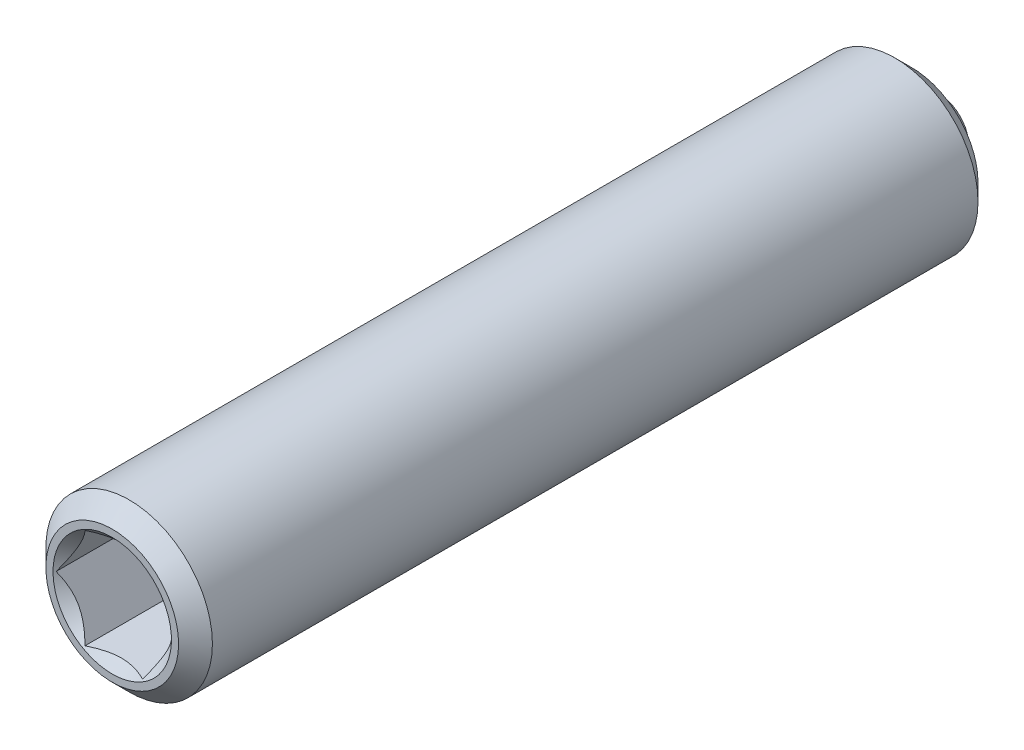
ISO-10303-21;
HEADER;
FILE_DESCRIPTION(('STEP AP214'),'2;1');
FILE_NAME('part.step','',(''),(''),'','','');
FILE_SCHEMA(('AUTOMOTIVE_DESIGN { 1 0 10303 214 1 1 1 1 }'));
ENDSEC;
DATA;
#1=APPLICATION_CONTEXT('core data for automotive mechanical design processes');
#2=APPLICATION_PROTOCOL_DEFINITION('international standard','automotive_design',2000,#1);
#3=PRODUCT_CONTEXT('',#1,'mechanical');
#4=PRODUCT('Part','Part','',(#3));
#5=PRODUCT_RELATED_PRODUCT_CATEGORY('part','',(#4));
#6=PRODUCT_DEFINITION_FORMATION('','',#4);
#7=PRODUCT_DEFINITION_CONTEXT('part definition',#1,'design');
#8=PRODUCT_DEFINITION('design','',#6,#7);
#9=PRODUCT_DEFINITION_SHAPE('','',#8);
#10=(LENGTH_UNIT() NAMED_UNIT(*) SI_UNIT(.MILLI.,.METRE.));
#11=(NAMED_UNIT(*) PLANE_ANGLE_UNIT() SI_UNIT($,.RADIAN.));
#12=(NAMED_UNIT(*) SI_UNIT($,.STERADIAN.) SOLID_ANGLE_UNIT());
#13=UNCERTAINTY_MEASURE_WITH_UNIT(LENGTH_MEASURE(1.E-05),#10,'distance_accuracy_value','');
#14=(GEOMETRIC_REPRESENTATION_CONTEXT(3) GLOBAL_UNCERTAINTY_ASSIGNED_CONTEXT((#13)) GLOBAL_UNIT_ASSIGNED_CONTEXT((#10,
#11,#12)) REPRESENTATION_CONTEXT('',''));
#15=CARTESIAN_POINT('',(0.,0.,0.));
#16=DIRECTION('',(0.,0.,1.));
#17=DIRECTION('',(1.,0.,0.));
#18=AXIS2_PLACEMENT_3D('',#15,#16,#17);
#19=CARTESIAN_POINT('',(-33.1630007981403,28.7089673374794,3.99521483447506));
#20=DIRECTION('',(0.,0.,-1.));
#21=DIRECTION('',(-1.,0.,0.));
#22=AXIS2_PLACEMENT_3D('',#19,#20,#21);
#23=PLANE('',#22);
#24=CARTESIAN_POINT('',(-33.1630007981403,28.7089673374794,3.99521483447506));
#25=DIRECTION('',(0.,0.,-1.));
#26=DIRECTION('',(0.,1.,0.));
#27=AXIS2_PLACEMENT_3D('',#24,#25,#26);
#28=CIRCLE('',#27,0.889);
#29=CARTESIAN_POINT('',(-33.1630007981403,29.5979673374794,3.99521483447506));
#30=VERTEX_POINT('',#29);
#31=EDGE_CURVE('P0_E164',#30,#30,#28,.T.);
#32=ORIENTED_EDGE('',*,*,#31,.T.);
#33=EDGE_LOOP('',(#32));
#34=FACE_BOUND('',#33,.T.);
#35=CARTESIAN_POINT('',(-33.1630007981403,28.7089673374794,3.99521483447506));
#36=DIRECTION('',(0.,0.,1.));
#37=DIRECTION('',(1.,0.,0.));
#38=AXIS2_PLACEMENT_3D('',#35,#36,#37);
#39=CIRCLE('',#38,0.996);
#40=CARTESIAN_POINT('',(-32.1670007981403,28.7089673374794,3.99521483447506));
#41=VERTEX_POINT('',#40);
#42=EDGE_CURVE('P0_E29',#41,#41,#39,.T.);
#43=ORIENTED_EDGE('',*,*,#42,.T.);
#44=EDGE_LOOP('',(#43));
#45=FACE_BOUND('',#44,.T.);
#46=ADVANCED_FACE('P0_F17',(#34,#45),#23,.F.);
#47=CARTESIAN_POINT('',(-33.1630007981403,28.7089673374794,3.74121483447506));
#48=DIRECTION('',(0.,0.,-1.));
#49=DIRECTION('',(-1.,0.,0.));
#50=AXIS2_PLACEMENT_3D('',#47,#48,#49);
#51=CONICAL_SURFACE('',#50,1.25,0.785398163397454);
#52=ORIENTED_EDGE('',*,*,#42,.F.);
#53=EDGE_LOOP('',(#52));
#54=FACE_BOUND('',#53,.T.);
#55=CARTESIAN_POINT('',(-33.1630007981403,28.7089673374794,3.74121483447506));
#56=DIRECTION('',(0.,0.,1.));
#57=DIRECTION('',(1.,0.,0.));
#58=AXIS2_PLACEMENT_3D('',#55,#56,#57);
#59=CIRCLE('',#58,1.25);
#60=CARTESIAN_POINT('',(-31.9130007981403,28.7089673374794,3.74121483447506));
#61=VERTEX_POINT('',#60);
#62=EDGE_CURVE('P0_E113',#61,#61,#59,.T.);
#63=ORIENTED_EDGE('',*,*,#62,.T.);
#64=EDGE_LOOP('',(#63));
#65=FACE_BOUND('',#64,.T.);
#66=ADVANCED_FACE('P0_F119',(#54,#65),#51,.T.);
#67=CARTESIAN_POINT('',(-33.1630007981403,28.7089673374794,57.6778825031788));
#68=DIRECTION('',(0.,0.,1.));
#69=DIRECTION('',(1.,0.,0.));
#70=AXIS2_PLACEMENT_3D('',#67,#68,#69);
#71=CYLINDRICAL_SURFACE('',#70,1.25);
#72=ORIENTED_EDGE('',*,*,#62,.F.);
#73=EDGE_LOOP('',(#72));
#74=FACE_BOUND('',#73,.T.);
#75=CARTESIAN_POINT('',(-33.1630007981403,28.7089673374794,-7.75078516552494));
#76=DIRECTION('',(0.,0.,1.));
#77=DIRECTION('',(1.,0.,0.));
#78=AXIS2_PLACEMENT_3D('',#75,#76,#77);
#79=CIRCLE('',#78,1.25);
#80=CARTESIAN_POINT('',(-31.9130007981403,28.7089673374794,-7.75078516552494));
#81=VERTEX_POINT('',#80);
#82=EDGE_CURVE('P0_E110',#81,#81,#79,.T.);
#83=ORIENTED_EDGE('',*,*,#82,.T.);
#84=EDGE_LOOP('',(#83));
#85=FACE_BOUND('',#84,.T.);
#86=ADVANCED_FACE('P0_F122',(#74,#85),#71,.T.);
#87=CARTESIAN_POINT('',(-33.1630007981403,28.7089673374794,-8.00478516552494));
#88=DIRECTION('',(0.,0.,1.));
#89=DIRECTION('',(1.,0.,0.));
#90=AXIS2_PLACEMENT_3D('',#87,#88,#89);
#91=CONICAL_SURFACE('',#90,0.996,0.78539816339744);
#92=ORIENTED_EDGE('',*,*,#82,.F.);
#93=EDGE_LOOP('',(#92));
#94=FACE_BOUND('',#93,.T.);
#95=CARTESIAN_POINT('',(-33.1630007981403,28.7089673374794,-8.00478516552494));
#96=DIRECTION('',(0.,0.,1.));
#97=DIRECTION('',(1.,0.,0.));
#98=AXIS2_PLACEMENT_3D('',#95,#96,#97);
#99=CIRCLE('',#98,0.996);
#100=CARTESIAN_POINT('',(-32.1670007981403,28.7089673374794,-8.00478516552494));
#101=VERTEX_POINT('',#100);
#102=EDGE_CURVE('P0_E107',#101,#101,#99,.T.);
#103=ORIENTED_EDGE('',*,*,#102,.T.);
#104=EDGE_LOOP('',(#103));
#105=FACE_BOUND('',#104,.T.);
#106=ADVANCED_FACE('P0_F127',(#94,#105),#91,.T.);
#107=CARTESIAN_POINT('',(-33.1630007981403,29.7049673374794,-8.00478516552494));
#108=DIRECTION('',(0.,0.,1.));
#109=DIRECTION('',(1.,0.,0.));
#110=AXIS2_PLACEMENT_3D('',#107,#108,#109);
#111=PLANE('',#110);
#112=ORIENTED_EDGE('',*,*,#102,.F.);
#113=EDGE_LOOP('',(#112));
#114=FACE_BOUND('',#113,.T.);
#115=CARTESIAN_POINT('',(-33.1630007981403,28.7089673374794,-8.00478516552494));
#116=DIRECTION('',(0.,0.,1.));
#117=DIRECTION('',(1.,0.,0.));
#118=AXIS2_PLACEMENT_3D('',#115,#116,#117);
#119=CIRCLE('',#118,0.75);
#120=CARTESIAN_POINT('',(-32.4130007981403,28.7089673374794,-8.00478516552494));
#121=VERTEX_POINT('',#120);
#122=EDGE_CURVE('P0_E104',#121,#121,#119,.T.);
#123=ORIENTED_EDGE('',*,*,#122,.T.);
#124=EDGE_LOOP('',(#123));
#125=FACE_BOUND('',#124,.T.);
#126=ADVANCED_FACE('P0_F133',(#114,#125),#111,.F.);
#127=CARTESIAN_POINT('',(-33.1630007981403,28.7089673374794,57.6778825031788));
#128=DIRECTION('',(0.,0.,1.));
#129=DIRECTION('',(1.,0.,0.));
#130=AXIS2_PLACEMENT_3D('',#127,#128,#129);
#131=CYLINDRICAL_SURFACE('',#130,0.75);
#132=ORIENTED_EDGE('',*,*,#122,.F.);
#133=EDGE_LOOP('',(#132));
#134=FACE_BOUND('',#133,.T.);
#135=CARTESIAN_POINT('',(-33.1630007981403,28.7089673374794,-7.50292499374512));
#136=DIRECTION('',(0.,0.,1.));
#137=DIRECTION('',(1.,0.,0.));
#138=AXIS2_PLACEMENT_3D('',#135,#136,#137);
#139=CIRCLE('',#138,0.75);
#140=CARTESIAN_POINT('',(-32.4130007981403,28.7089673374794,-7.50292499374512));
#141=VERTEX_POINT('',#140);
#142=EDGE_CURVE('P0_E101',#141,#141,#139,.T.);
#143=ORIENTED_EDGE('',*,*,#142,.T.);
#144=EDGE_LOOP('',(#143));
#145=FACE_BOUND('',#144,.T.);
#146=ADVANCED_FACE('P0_F139',(#134,#145),#131,.F.);
#147=CARTESIAN_POINT('',(-33.1630007981403,28.7089673374794,-6.75292499374511));
#148=DIRECTION('',(0.,0.,-1.));
#149=DIRECTION('',(-1.,0.,0.));
#150=AXIS2_PLACEMENT_3D('',#147,#148,#149);
#151=CONICAL_SURFACE('',#150,0.,0.785398163397436);
#152=ORIENTED_EDGE('',*,*,#142,.F.);
#153=EDGE_LOOP('',(#152));
#154=FACE_BOUND('',#153,.T.);
#155=CARTESIAN_POINT('',(-33.1630007981403,28.7089673374794,-6.75292499374511));
#156=VERTEX_POINT('',#155);
#157=VERTEX_LOOP('',#156);
#158=FACE_BOUND('',#157,.T.);
#159=ADVANCED_FACE('P0_F145',(#154,#158),#151,.F.);
#160=CARTESIAN_POINT('',(-33.1630007981403,28.7089673374794,3.10621483447507));
#161=DIRECTION('',(0.,0.,1.));
#162=DIRECTION('',(0.,-1.,0.));
#163=AXIS2_PLACEMENT_3D('',#160,#161,#162);
#164=CONICAL_SURFACE('',#163,0.,0.785398163397453);
#165=ORIENTED_EDGE('',*,*,#31,.F.);
#166=EDGE_LOOP('',(#165));
#167=FACE_BOUND('',#166,.T.);
#168=CARTESIAN_POINT('',(-34.0425134321986,27.9589673374794,4.26208786966026));
#169=CARTESIAN_POINT('',(-34.0211681100344,27.9589673374794,4.24584847947383));
#170=CARTESIAN_POINT('',(-33.9997055705422,27.9589673374794,4.22976358783385));
#171=CARTESIAN_POINT('',(-33.9564979950275,27.9589673374794,4.19796706739637));
#172=CARTESIAN_POINT('',(-33.9347528915436,27.9589673374794,4.18225553036631));
#173=CARTESIAN_POINT('',(-33.8687032144859,27.9589673374794,4.13555296646633));
#174=CARTESIAN_POINT('',(-33.8239085172943,27.9589673374794,4.10524382432147));
#175=CARTESIAN_POINT('',(-33.7298709247186,27.9589673374794,4.04559584174304));
#176=CARTESIAN_POINT('',(-33.6805219918868,27.9589673374794,4.01642227384625));
#177=CARTESIAN_POINT('',(-33.579342395383,27.9589673374794,3.96295382695284));
#178=CARTESIAN_POINT('',(-33.5275208693121,27.9589673374794,3.93864248318659));
#179=CARTESIAN_POINT('',(-33.4498788861714,27.9589673374794,3.90889806815176));
#180=CARTESIAN_POINT('',(-33.4252462031009,27.9589673374794,3.90038894634061));
#181=CARTESIAN_POINT('',(-33.3753858857222,27.9589673374794,3.88534110821305));
#182=CARTESIAN_POINT('',(-33.3501582118539,27.9589673374794,3.87880252331567));
#183=CARTESIAN_POINT('',(-33.2746553170791,27.9589673374794,3.86292205991524));
#184=CARTESIAN_POINT('',(-33.2235971883066,27.9589673374794,3.85692036145107));
#185=CARTESIAN_POINT('',(-33.1233397305914,27.9589673374794,3.85565407881636));
#186=CARTESIAN_POINT('',(-33.0741456969587,27.9589673374794,3.85997925251151));
#187=CARTESIAN_POINT('',(-33.0012050800911,27.9589673374794,3.87307755969887));
#188=CARTESIAN_POINT('',(-32.9768127738479,27.9589673374794,3.87862812797234));
#189=CARTESIAN_POINT('',(-32.9285520824627,27.9589673374794,3.89166394378376));
#190=CARTESIAN_POINT('',(-32.9046836591211,27.9589673374794,3.89914904975033));
#191=CARTESIAN_POINT('',(-32.8302496642989,27.9589673374794,3.92532907949655));
#192=CARTESIAN_POINT('',(-32.7807289039953,27.9589673374794,3.94697769298001));
#193=CARTESIAN_POINT('',(-32.6840052994642,27.9589673374794,3.9951286727266));
#194=CARTESIAN_POINT('',(-32.6368115002835,27.9589673374794,4.02164833509715));
#195=CARTESIAN_POINT('',(-32.546608344391,27.9589673374794,4.07638182509845));
#196=CARTESIAN_POINT('',(-32.5035074965681,27.9589673374794,4.10444679240507));
#197=CARTESIAN_POINT('',(-32.4400071849266,27.9589673374794,4.14784121680964));
#198=CARTESIAN_POINT('',(-32.4191140713776,27.9589673374794,4.16246076309093));
#199=CARTESIAN_POINT('',(-32.3776138434408,27.9589673374794,4.19208888193886));
#200=CARTESIAN_POINT('',(-32.357006652308,27.9589673374794,4.20709734688724));
#201=CARTESIAN_POINT('',(-32.3365186272487,27.9589673374794,4.22226715350033));
#202=B_SPLINE_CURVE_WITH_KNOTS('',3,(#168,#169,#170,#171,#172,#173,#174,#175,#176,#177,#178,
#179,#180,#181,#182,#183,#184,#185,#186,#187,#188,#189,#190,#191,#192,#193,#194,#195,#196,#197,
#198,#199,#200,#201),.UNSPECIFIED.,.F.,.F.,(4,2,2,2,2,2,2,2,2,2,2,2,2,2,2,2,4),(0.,
0.0804596117681703,0.160938799452029,0.323124453194979,0.494968571191812,0.666220542229091,
0.744331171665941,0.822447009304217,0.9755971520518,1.12276514368749,1.1977430644728,
1.2727154998528,1.43438364653411,1.59663734906445,1.75085876684993,1.82735598888856,
1.90383226465776),.UNSPECIFIED.);
#203=CARTESIAN_POINT('',(-33.5960135000325,27.9589673374794,3.9722402382595));
#204=VERTEX_POINT('',#203);
#205=CARTESIAN_POINT('',(-32.7299880962481,27.9589673374794,3.9722402382595));
#206=VERTEX_POINT('',#205);
#207=EDGE_CURVE('P0_E85',#204,#206,#202,.T.);
#208=ORIENTED_EDGE('',*,*,#207,.F.);
#209=CARTESIAN_POINT('',(-34.0291416719786,28.7091673374794,3.97235573140427));
#210=CARTESIAN_POINT('',(-34.0142518301535,28.6833773749217,3.95747434872342));
#211=CARTESIAN_POINT('',(-33.9991129904287,28.6571561353507,3.94346650386645));
#212=CARTESIAN_POINT('',(-33.9682429340346,28.6036876292437,3.91781776294176));
#213=CARTESIAN_POINT('',(-33.9525087771001,28.5764352700188,3.90619114996516));
#214=CARTESIAN_POINT('',(-33.9207814844129,28.5214819870981,3.88627428403174));
#215=CARTESIAN_POINT('',(-33.9047964415994,28.4937950807839,3.87793393234087));
#216=CARTESIAN_POINT('',(-33.8724744460836,28.4378117423486,3.86508298022093));
#217=CARTESIAN_POINT('',(-33.8561384820408,28.4095170226358,3.86056277884834));
#218=CARTESIAN_POINT('',(-33.8279868976807,28.3607570482106,3.85648607135694));
#219=CARTESIAN_POINT('',(-33.8162079265919,28.3403552718238,3.85588303487358));
#220=CARTESIAN_POINT('',(-33.792672780358,28.299591202783,3.85689474427502));
#221=CARTESIAN_POINT('',(-33.7809166108125,28.279228919828,3.85850997924953));
#222=CARTESIAN_POINT('',(-33.7458159514267,28.2184327943926,3.86657638523254));
#223=CARTESIAN_POINT('',(-33.722646127693,28.1783014824833,3.87624917408722));
#224=CARTESIAN_POINT('',(-33.6819749504676,28.1078569371254,3.89959655623182));
#225=CARTESIAN_POINT('',(-33.6642831070638,28.0772137654703,3.91204879633175));
#226=CARTESIAN_POINT('',(-33.6295925693883,28.0171279916746,3.94009984849036));
#227=CARTESIAN_POINT('',(-33.612591831045,27.9876818490978,3.95568842416325));
#228=CARTESIAN_POINT('',(-33.5958980299787,27.9587673374794,3.97235573140427));
#229=B_SPLINE_CURVE_WITH_KNOTS('',3,(#209,#210,#211,#212,#213,#214,#215,#216,#217,#218,#219,
#220,#221,#222,#223,#224,#225,#226,#227,#228),.UNSPECIFIED.,.F.,.F.,(4,2,2,2,2,2,2,2,2,4),(0.,
0.0999419466095622,0.200466857654447,0.299393763705714,0.39807129730023,0.468665775681748,
0.539275821398842,0.68053625724457,0.792918418368075,0.904939568716029),.UNSPECIFIED.);
#230=CARTESIAN_POINT('',(-34.0290262019247,28.7089673374794,3.9722402382595));
#231=VERTEX_POINT('',#230);
#232=EDGE_CURVE('P0_E227',#231,#204,#229,.T.);
#233=ORIENTED_EDGE('',*,*,#232,.F.);
#234=CARTESIAN_POINT('',(-33.5958980299787,29.4591673374794,3.97235573140427));
#235=CARTESIAN_POINT('',(-33.6107878718037,29.4333773749217,3.95747434872342));
#236=CARTESIAN_POINT('',(-33.6259267115285,29.4071561353507,3.94346650386646));
#237=CARTESIAN_POINT('',(-33.6567967679226,29.3536876292437,3.91781776294176));
#238=CARTESIAN_POINT('',(-33.6725309248571,29.3264352700188,3.90619114996517));
#239=CARTESIAN_POINT('',(-33.7042582175443,29.2714819870981,3.88627428403175));
#240=CARTESIAN_POINT('',(-33.7202432603578,29.2437950807839,3.87793393234087));
#241=CARTESIAN_POINT('',(-33.7525652558736,29.1878117423486,3.86508298022093));
#242=CARTESIAN_POINT('',(-33.7689012199164,29.1595170226358,3.86056277884834));
#243=CARTESIAN_POINT('',(-33.7970528042765,29.1107570482106,3.85648607135694));
#244=CARTESIAN_POINT('',(-33.8088317753653,29.0903552718238,3.85588303487358));
#245=CARTESIAN_POINT('',(-33.8323669215992,29.0495912027831,3.85689474427503));
#246=CARTESIAN_POINT('',(-33.8441230911447,29.029228919828,3.85850997924954));
#247=CARTESIAN_POINT('',(-33.8792237505305,28.9684327943926,3.86657638523254));
#248=CARTESIAN_POINT('',(-33.9023935742642,28.9283014824833,3.87624917408722));
#249=CARTESIAN_POINT('',(-33.9430647514896,28.8578569371254,3.89959655623182));
#250=CARTESIAN_POINT('',(-33.9607565948934,28.8272137654703,3.91204879633175));
#251=CARTESIAN_POINT('',(-33.9954471325689,28.7671279916746,3.94009984849036));
#252=CARTESIAN_POINT('',(-34.0124478709122,28.7376818490978,3.95568842416325));
#253=CARTESIAN_POINT('',(-34.0291416719786,28.7087673374794,3.97235573140427));
#254=B_SPLINE_CURVE_WITH_KNOTS('',3,(#234,#235,#236,#237,#238,#239,#240,#241,#242,#243,#244,
#245,#246,#247,#248,#249,#250,#251,#252,#253),.UNSPECIFIED.,.F.,.F.,(4,2,2,2,2,2,2,2,2,4),(0.,
0.0999419466095608,0.200466857654445,0.299393763705715,0.398071297300228,0.468665775681741,
0.539275821398838,0.680536257244568,0.792918418368071,0.904939568716026),.UNSPECIFIED.);
#255=CARTESIAN_POINT('',(-33.5960135000325,29.4589673374794,3.9722402382595));
#256=VERTEX_POINT('',#255);
#257=EDGE_CURVE('P0_E166',#256,#231,#254,.T.);
#258=ORIENTED_EDGE('',*,*,#257,.F.);
#259=CARTESIAN_POINT('',(-34.0425134322245,29.4589673374794,4.26208786967996));
#260=CARTESIAN_POINT('',(-34.0211681100595,29.4589673374794,4.24584847949277));
#261=CARTESIAN_POINT('',(-33.9997055705666,29.4589673374794,4.22976358785203));
#262=CARTESIAN_POINT('',(-33.9564979950504,29.4589673374794,4.19796706741305));
#263=CARTESIAN_POINT('',(-33.9347528915658,29.4589673374794,4.18225553038223));
#264=CARTESIAN_POINT('',(-33.8687032145059,29.4589673374794,4.13555296647996));
#265=CARTESIAN_POINT('',(-33.8239085173127,29.4589673374794,4.10524382433359));
#266=CARTESIAN_POINT('',(-33.7298709247336,29.4589673374794,4.04559584175205));
#267=CARTESIAN_POINT('',(-33.6805219919,29.4589673374794,4.01642227385366));
#268=CARTESIAN_POINT('',(-33.5793423953923,29.4589673374794,3.96295382695729));
#269=CARTESIAN_POINT('',(-33.5275208693195,29.4589673374794,3.93864248318969));
#270=CARTESIAN_POINT('',(-33.4498788861772,29.4589673374794,3.90889806815386));
#271=CARTESIAN_POINT('',(-33.4252462031073,29.4589673374794,3.90038894634276));
#272=CARTESIAN_POINT('',(-33.3753858857299,29.4589673374794,3.88534110821518));
#273=CARTESIAN_POINT('',(-33.3501582118623,29.4589673374794,3.87880252331773));
#274=CARTESIAN_POINT('',(-33.2746553170894,29.4589673374794,3.86292205991685));
#275=CARTESIAN_POINT('',(-33.2235971883182,29.4589673374794,3.85692036145209));
#276=CARTESIAN_POINT('',(-33.1233397306052,29.4589673374794,3.85565407881571));
#277=CARTESIAN_POINT('',(-33.0741456969734,29.4589673374794,3.85997925250981));
#278=CARTESIAN_POINT('',(-33.0012050801071,29.4589673374794,3.8730775596955));
#279=CARTESIAN_POINT('',(-32.9768127738643,29.4589673374794,3.87862812796839));
#280=CARTESIAN_POINT('',(-32.9285520824799,29.4589673374794,3.89166394377862));
#281=CARTESIAN_POINT('',(-32.9046836591387,29.4589673374794,3.8991490497446));
#282=CARTESIAN_POINT('',(-32.8302496643203,29.4589673374794,3.92532907948802));
#283=CARTESIAN_POINT('',(-32.78072890402,29.4589673374794,3.94697769296891));
#284=CARTESIAN_POINT('',(-32.684005299495,29.4589673374794,3.99512867271007));
#285=CARTESIAN_POINT('',(-32.6368115003173,29.4589673374794,4.02164833507776));
#286=CARTESIAN_POINT('',(-32.5466083444301,29.4589673374794,4.07638182507359));
#287=CARTESIAN_POINT('',(-32.5035074966097,29.4589673374794,4.10444679237763));
#288=CARTESIAN_POINT('',(-32.4400071849717,29.4589673374794,4.14784121677833));
#289=CARTESIAN_POINT('',(-32.4191140714238,29.4589673374794,4.16246076305834));
#290=CARTESIAN_POINT('',(-32.3776138434894,29.4589673374794,4.19208888190372));
#291=CARTESIAN_POINT('',(-32.3570066523577,29.4589673374794,4.20709734685082));
#292=CARTESIAN_POINT('',(-32.3365186272996,29.4589673374794,4.22226715346264));
#293=B_SPLINE_CURVE_WITH_KNOTS('',3,(#259,#260,#261,#262,#263,#264,#265,#266,#267,#268,#269,
#270,#271,#272,#273,#274,#275,#276,#277,#278,#279,#280,#281,#282,#283,#284,#285,#286,#287,#288,
#289,#290,#291,#292),.UNSPECIFIED.,.F.,.F.,(4,2,2,2,2,2,2,2,2,2,2,2,2,2,2,2,4),(0.,
0.0804596117713149,0.160938799458303,0.323124453207644,0.494968571211668,0.666220542256048,
0.744331171691058,0.82244700932749,0.975597152071559,1.12276514370424,1.19774306448795,
1.2727154998663,1.4343836465357,1.59663734905405,1.75085876682929,1.82735598886285,
1.903832264627),.UNSPECIFIED.);
#294=CARTESIAN_POINT('',(-32.7299880962481,29.4589673374794,3.9722402382595));
#295=VERTEX_POINT('',#294);
#296=EDGE_CURVE('P0_E36',#295,#256,#293,.F.);
#297=ORIENTED_EDGE('',*,*,#296,.F.);
#298=CARTESIAN_POINT('',(-32.296859924302,28.7087673374794,3.97235573140427));
#299=CARTESIAN_POINT('',(-32.3117497661271,28.7345573000371,3.95747434872342));
#300=CARTESIAN_POINT('',(-32.3268886058519,28.7607785396081,3.94346650386645));
#301=CARTESIAN_POINT('',(-32.3577586622459,28.8142470457151,3.91781776294176));
#302=CARTESIAN_POINT('',(-32.3734928191805,28.84149940494,3.90619114996516));
#303=CARTESIAN_POINT('',(-32.4052201118676,28.8964526878608,3.88627428403174));
#304=CARTESIAN_POINT('',(-32.4212051546811,28.9241395941749,3.87793393234087));
#305=CARTESIAN_POINT('',(-32.4535271501969,28.9801229326103,3.86508298022093));
#306=CARTESIAN_POINT('',(-32.4698631142397,29.0084176523231,3.86056277884834));
#307=CARTESIAN_POINT('',(-32.4980146985998,29.0571776267483,3.85648607135694));
#308=CARTESIAN_POINT('',(-32.5097936696886,29.077579403135,3.85588303487358));
#309=CARTESIAN_POINT('',(-32.5333288159226,29.1183434721758,3.85689474427502));
#310=CARTESIAN_POINT('',(-32.545084985468,29.1387057551309,3.85850997924953));
#311=CARTESIAN_POINT('',(-32.5801856448538,29.1995018805662,3.86657638523254));
#312=CARTESIAN_POINT('',(-32.6033554685876,29.2396331924755,3.87624917408722));
#313=CARTESIAN_POINT('',(-32.6440266458129,29.3100777378334,3.89959655623182));
#314=CARTESIAN_POINT('',(-32.6617184892168,29.3407209094885,3.91204879633175));
#315=CARTESIAN_POINT('',(-32.6964090268922,29.4008066832842,3.94009984849036));
#316=CARTESIAN_POINT('',(-32.7134097652355,29.430252825861,3.95568842416325));
#317=CARTESIAN_POINT('',(-32.7301035663019,29.4591673374794,3.97235573140427));
#318=B_SPLINE_CURVE_WITH_KNOTS('',3,(#298,#299,#300,#301,#302,#303,#304,#305,#306,#307,#308,
#309,#310,#311,#312,#313,#314,#315,#316,#317),.UNSPECIFIED.,.F.,.F.,(4,2,2,2,2,2,2,2,2,4),(0.,
0.0999419466095622,0.200466857654447,0.299393763705714,0.39807129730023,0.468665775681749,
0.539275821398842,0.68053625724457,0.792918418368072,0.904939568716029),.UNSPECIFIED.);
#319=CARTESIAN_POINT('',(-32.2969753943558,28.7089673374794,3.9722402382595));
#320=VERTEX_POINT('',#319);
#321=EDGE_CURVE('P0_E11',#320,#295,#318,.T.);
#322=ORIENTED_EDGE('',*,*,#321,.F.);
#323=CARTESIAN_POINT('',(-32.7301035663019,27.9587673374794,3.97235573140427));
#324=CARTESIAN_POINT('',(-32.7152137244768,27.9845573000371,3.95747434872342));
#325=CARTESIAN_POINT('',(-32.700074884752,28.0107785396081,3.94346650386646));
#326=CARTESIAN_POINT('',(-32.669204828358,28.0642470457151,3.91781776294176));
#327=CARTESIAN_POINT('',(-32.6534706714234,28.09149940494,3.90619114996517));
#328=CARTESIAN_POINT('',(-32.6217433787363,28.1464526878608,3.88627428403175));
#329=CARTESIAN_POINT('',(-32.6057583359228,28.1741395941749,3.87793393234087));
#330=CARTESIAN_POINT('',(-32.573436340407,28.2301229326103,3.86508298022093));
#331=CARTESIAN_POINT('',(-32.5571003763642,28.2584176523231,3.86056277884834));
#332=CARTESIAN_POINT('',(-32.5289487920041,28.3071776267483,3.85648607135694));
#333=CARTESIAN_POINT('',(-32.5171698209153,28.327579403135,3.85588303487358));
#334=CARTESIAN_POINT('',(-32.4936346746813,28.3683434721758,3.85689474427503));
#335=CARTESIAN_POINT('',(-32.4818785051359,28.3887057551309,3.85850997924954));
#336=CARTESIAN_POINT('',(-32.4467778457501,28.4495018805662,3.86657638523254));
#337=CARTESIAN_POINT('',(-32.4236080220163,28.4896331924755,3.87624917408722));
#338=CARTESIAN_POINT('',(-32.382936844791,28.5600777378334,3.89959655623182));
#339=CARTESIAN_POINT('',(-32.3652450013871,28.5907209094885,3.91204879633175));
#340=CARTESIAN_POINT('',(-32.3305544637117,28.6508066832842,3.94009984849036));
#341=CARTESIAN_POINT('',(-32.3135537253684,28.680252825861,3.95568842416325));
#342=CARTESIAN_POINT('',(-32.296859924302,28.7091673374794,3.97235573140427));
#343=B_SPLINE_CURVE_WITH_KNOTS('',3,(#323,#324,#325,#326,#327,#328,#329,#330,#331,#332,#333,
#334,#335,#336,#337,#338,#339,#340,#341,#342),.UNSPECIFIED.,.F.,.F.,(4,2,2,2,2,2,2,2,2,4),(0.,
0.0999419466095608,0.200466857654445,0.299393763705715,0.398071297300228,0.46866577568175,
0.539275821398844,0.680536257244568,0.792918418368071,0.904939568716027),.UNSPECIFIED.);
#344=EDGE_CURVE('P0_E72',#206,#320,#343,.T.);
#345=ORIENTED_EDGE('',*,*,#344,.F.);
#346=EDGE_LOOP('',(#208,#233,#258,#297,#322,#345));
#347=FACE_BOUND('',#346,.T.);
#348=ADVANCED_FACE('P0_F71',(#167,#347),#164,.F.);
#349=CARTESIAN_POINT('',(-32.2969753943558,28.7089673374794,0.947214834475063));
#350=DIRECTION('',(0.,0.,1.));
#351=DIRECTION('',(1.,0.,0.));
#352=AXIS2_PLACEMENT_3D('',#349,#350,#351);
#353=PLANE('',#352);
#354=DIRECTION('',(0.5,0.866025403784439,0.));
#355=VECTOR('',#354,1.);
#356=CARTESIAN_POINT('',(-32.7299880962481,27.9589673374794,0.947214834475063));
#357=LINE('',#356,#355);
#358=CARTESIAN_POINT('',(-32.7299880962481,27.9589673374794,0.947214834475063));
#359=VERTEX_POINT('',#358);
#360=CARTESIAN_POINT('',(-32.2969753943558,28.7089673374794,0.947214834475063));
#361=VERTEX_POINT('',#360);
#362=EDGE_CURVE('P0_E84',#359,#361,#357,.T.);
#363=ORIENTED_EDGE('',*,*,#362,.T.);
#364=DIRECTION('',(-0.500000000000001,0.866025403784438,0.));
#365=VECTOR('',#364,1.);
#366=CARTESIAN_POINT('',(-32.2969753943558,28.7089673374794,0.947214834475063));
#367=LINE('',#366,#365);
#368=CARTESIAN_POINT('',(-32.7299880962481,29.4589673374794,0.947214834475063));
#369=VERTEX_POINT('',#368);
#370=EDGE_CURVE('P0_E89',#361,#369,#367,.T.);
#371=ORIENTED_EDGE('',*,*,#370,.T.);
#372=DIRECTION('',(-1.,0.,0.));
#373=VECTOR('',#372,1.);
#374=CARTESIAN_POINT('',(-32.7299880962481,29.4589673374794,0.947214834475063));
#375=LINE('',#374,#373);
#376=CARTESIAN_POINT('',(-33.5960135000325,29.4589673374794,0.947214834475063));
#377=VERTEX_POINT('',#376);
#378=EDGE_CURVE('P0_E203',#369,#377,#375,.T.);
#379=ORIENTED_EDGE('',*,*,#378,.T.);
#380=DIRECTION('',(-0.5,-0.866025403784439,0.));
#381=VECTOR('',#380,1.);
#382=CARTESIAN_POINT('',(-33.5960135000325,29.4589673374794,0.947214834475063));
#383=LINE('',#382,#381);
#384=CARTESIAN_POINT('',(-34.0290262019247,28.7089673374794,0.947214834475063));
#385=VERTEX_POINT('',#384);
#386=EDGE_CURVE('P0_E206',#377,#385,#383,.T.);
#387=ORIENTED_EDGE('',*,*,#386,.T.);
#388=DIRECTION('',(0.5,-0.866025403784438,0.));
#389=VECTOR('',#388,1.);
#390=CARTESIAN_POINT('',(-34.0290262019247,28.7089673374794,0.947214834475063));
#391=LINE('',#390,#389);
#392=CARTESIAN_POINT('',(-33.5960135000325,27.9589673374794,0.947214834475063));
#393=VERTEX_POINT('',#392);
#394=EDGE_CURVE('P0_E97',#385,#393,#391,.T.);
#395=ORIENTED_EDGE('',*,*,#394,.T.);
#396=DIRECTION('',(1.,0.,0.));
#397=VECTOR('',#396,1.);
#398=CARTESIAN_POINT('',(-33.5960135000325,27.9589673374794,0.947214834475063));
#399=LINE('',#398,#397);
#400=EDGE_CURVE('P0_E92',#393,#359,#399,.T.);
#401=ORIENTED_EDGE('',*,*,#400,.T.);
#402=EDGE_LOOP('',(#363,#371,#379,#387,#395,#401));
#403=FACE_BOUND('',#402,.T.);
#404=ADVANCED_FACE('P0_F155',(#403),#353,.T.);
#405=CARTESIAN_POINT('',(-32.2969753943558,28.7089673374794,0.947214834475063));
#406=DIRECTION('',(0.866025403784438,0.500000000000001,0.));
#407=DIRECTION('',(-0.500000000000001,0.866025403784438,0.));
#408=AXIS2_PLACEMENT_3D('',#405,#406,#407);
#409=PLANE('',#408);
#410=DIRECTION('',(0.,0.,1.));
#411=VECTOR('',#410,1.);
#412=CARTESIAN_POINT('',(-32.2969753943558,28.7089673374794,0.947214834475063));
#413=LINE('',#412,#411);
#414=EDGE_CURVE('P0_E81',#361,#320,#413,.T.);
#415=ORIENTED_EDGE('',*,*,#414,.T.);
#416=ORIENTED_EDGE('',*,*,#321,.T.);
#417=DIRECTION('',(0.,0.,1.));
#418=VECTOR('',#417,1.);
#419=CARTESIAN_POINT('',(-32.7299880962481,29.4589673374794,0.947214834475063));
#420=LINE('',#419,#418);
#421=EDGE_CURVE('P0_E91',#369,#295,#420,.T.);
#422=ORIENTED_EDGE('',*,*,#421,.F.);
#423=ORIENTED_EDGE('',*,*,#370,.F.);
#424=EDGE_LOOP('',(#415,#416,#422,#423));
#425=FACE_BOUND('',#424,.T.);
#426=ADVANCED_FACE('P0_F87',(#425),#409,.F.);
#427=CARTESIAN_POINT('',(-32.7299880962481,29.4589673374794,0.947214834475063));
#428=DIRECTION('',(0.,1.,0.));
#429=DIRECTION('',(-1.,0.,0.));
#430=AXIS2_PLACEMENT_3D('',#427,#428,#429);
#431=PLANE('',#430);
#432=ORIENTED_EDGE('',*,*,#421,.T.);
#433=ORIENTED_EDGE('',*,*,#296,.T.);
#434=DIRECTION('',(0.,0.,1.));
#435=VECTOR('',#434,1.);
#436=CARTESIAN_POINT('',(-33.5960135000325,29.4589673374794,0.947214834475063));
#437=LINE('',#436,#435);
#438=EDGE_CURVE('P0_E94',#377,#256,#437,.T.);
#439=ORIENTED_EDGE('',*,*,#438,.F.);
#440=ORIENTED_EDGE('',*,*,#378,.F.);
#441=EDGE_LOOP('',(#432,#433,#439,#440));
#442=FACE_BOUND('',#441,.T.);
#443=ADVANCED_FACE('P0_F180',(#442),#431,.F.);
#444=CARTESIAN_POINT('',(-33.5960135000325,29.4589673374794,0.947214834475063));
#445=DIRECTION('',(-0.866025403784439,0.5,0.));
#446=DIRECTION('',(-0.5,-0.866025403784439,0.));
#447=AXIS2_PLACEMENT_3D('',#444,#445,#446);
#448=PLANE('',#447);
#449=ORIENTED_EDGE('',*,*,#438,.T.);
#450=ORIENTED_EDGE('',*,*,#257,.T.);
#451=DIRECTION('',(0.,0.,1.));
#452=VECTOR('',#451,1.);
#453=CARTESIAN_POINT('',(-34.0290262019247,28.7089673374794,0.947214834475063));
#454=LINE('',#453,#452);
#455=EDGE_CURVE('P0_E215',#385,#231,#454,.T.);
#456=ORIENTED_EDGE('',*,*,#455,.F.);
#457=ORIENTED_EDGE('',*,*,#386,.F.);
#458=EDGE_LOOP('',(#449,#450,#456,#457));
#459=FACE_BOUND('',#458,.T.);
#460=ADVANCED_FACE('P0_F183',(#459),#448,.F.);
#461=CARTESIAN_POINT('',(-34.0290262019247,28.7089673374794,0.947214834475063));
#462=DIRECTION('',(-0.866025403784438,-0.5,0.));
#463=DIRECTION('',(0.5,-0.866025403784438,0.));
#464=AXIS2_PLACEMENT_3D('',#461,#462,#463);
#465=PLANE('',#464);
#466=ORIENTED_EDGE('',*,*,#455,.T.);
#467=ORIENTED_EDGE('',*,*,#232,.T.);
#468=DIRECTION('',(0.,0.,1.));
#469=VECTOR('',#468,1.);
#470=CARTESIAN_POINT('',(-33.5960135000325,27.9589673374794,0.947214834475063));
#471=LINE('',#470,#469);
#472=EDGE_CURVE('P0_E212',#393,#204,#471,.T.);
#473=ORIENTED_EDGE('',*,*,#472,.F.);
#474=ORIENTED_EDGE('',*,*,#394,.F.);
#475=EDGE_LOOP('',(#466,#467,#473,#474));
#476=FACE_BOUND('',#475,.T.);
#477=ADVANCED_FACE('P0_F232',(#476),#465,.F.);
#478=CARTESIAN_POINT('',(-33.5960135000325,27.9589673374794,0.947214834475063));
#479=DIRECTION('',(0.,-1.,0.));
#480=DIRECTION('',(0.,0.,-1.));
#481=AXIS2_PLACEMENT_3D('',#478,#479,#480);
#482=PLANE('',#481);
#483=ORIENTED_EDGE('',*,*,#472,.T.);
#484=ORIENTED_EDGE('',*,*,#207,.T.);
#485=DIRECTION('',(0.,0.,1.));
#486=VECTOR('',#485,1.);
#487=CARTESIAN_POINT('',(-32.7299880962481,27.9589673374794,0.947214834475063));
#488=LINE('',#487,#486);
#489=EDGE_CURVE('P0_E83',#359,#206,#488,.T.);
#490=ORIENTED_EDGE('',*,*,#489,.F.);
#491=ORIENTED_EDGE('',*,*,#400,.F.);
#492=EDGE_LOOP('',(#483,#484,#490,#491));
#493=FACE_BOUND('',#492,.T.);
#494=ADVANCED_FACE('P0_F191',(#493),#482,.F.);
#495=CARTESIAN_POINT('',(-32.7299880962481,27.9589673374794,0.947214834475063));
#496=DIRECTION('',(0.866025403784439,-0.5,0.));
#497=DIRECTION('',(0.5,0.866025403784439,0.));
#498=AXIS2_PLACEMENT_3D('',#495,#496,#497);
#499=PLANE('',#498);
#500=ORIENTED_EDGE('',*,*,#489,.T.);
#501=ORIENTED_EDGE('',*,*,#344,.T.);
#502=ORIENTED_EDGE('',*,*,#414,.F.);
#503=ORIENTED_EDGE('',*,*,#362,.F.);
#504=EDGE_LOOP('',(#500,#501,#502,#503));
#505=FACE_BOUND('',#504,.T.);
#506=ADVANCED_FACE('P0_F79',(#505),#499,.F.);
#507=CLOSED_SHELL('',(#46,#66,#86,#106,#126,#146,#159,#348,#404,#426,#443,#460,#477,#494,#506));
#508=MANIFOLD_SOLID_BREP('P0_B1',#507);
#509=CARTESIAN_POINT('',(-33.1630007981403,28.7089673374794,-7.81358516552495));
#510=DIRECTION('',(0.,0.,-1.));
#511=DIRECTION('',(1.,0.,0.));
#512=AXIS2_PLACEMENT_3D('',#509,#510,#511);
#513=SPHERICAL_SURFACE('',#512,0.75);
#514=CARTESIAN_POINT('',(-33.1630007981403,28.7089673374794,-7.81358516552495));
#515=DIRECTION('',(0.,0.999999999999956,0.));
#516=DIRECTION('',(1.,0.,0.));
#517=AXIS2_PLACEMENT_3D('',#514,#515,#516);
#518=CIRCLE('',#517,0.75);
#519=CARTESIAN_POINT('',(-32.4130007981403,28.7089673374794,-7.81358516552495));
#520=VERTEX_POINT('',#519);
#521=CARTESIAN_POINT('',(-33.9130007981403,28.7089673374794,-7.81358516552495));
#522=VERTEX_POINT('',#521);
#523=EDGE_CURVE('P1_E33',#520,#522,#518,.T.);
#524=ORIENTED_EDGE('',*,*,#523,.T.);
#525=CARTESIAN_POINT('',(-33.1630007981403,28.7089673374794,-7.81358516552495));
#526=DIRECTION('',(0.,0.,-1.));
#527=DIRECTION('',(0.,0.999999999999956,0.));
#528=AXIS2_PLACEMENT_3D('',#525,#526,#527);
#529=CIRCLE('',#528,0.75);
#530=EDGE_CURVE('P1_E10',#522,#520,#529,.T.);
#531=ORIENTED_EDGE('',*,*,#530,.T.);
#532=EDGE_LOOP('',(#524,#531));
#533=FACE_BOUND('',#532,.T.);
#534=ADVANCED_FACE('P1_F16',(#533),#513,.T.);
#535=ORIENTED_EDGE('',*,*,#523,.F.);
#536=CARTESIAN_POINT('',(-33.1630007981403,28.7089673374794,-7.81358516552495));
#537=DIRECTION('',(0.,0.,-1.));
#538=DIRECTION('',(0.,0.999999999999956,0.));
#539=AXIS2_PLACEMENT_3D('',#536,#537,#538);
#540=CIRCLE('',#539,0.75);
#541=EDGE_CURVE('P1_E23',#520,#522,#540,.T.);
#542=ORIENTED_EDGE('',*,*,#541,.T.);
#543=EDGE_LOOP('',(#535,#542));
#544=FACE_BOUND('',#543,.T.);
#545=ADVANCED_FACE('P1_F40',(#544),#513,.T.);
#546=ORIENTED_EDGE('',*,*,#530,.F.);
#547=EDGE_CURVE('P1_E36',#522,#520,#518,.T.);
#548=ORIENTED_EDGE('',*,*,#547,.T.);
#549=EDGE_LOOP('',(#546,#548));
#550=FACE_BOUND('',#549,.T.);
#551=ADVANCED_FACE('P1_F38',(#550),#513,.T.);
#552=ORIENTED_EDGE('',*,*,#541,.F.);
#553=ORIENTED_EDGE('',*,*,#547,.F.);
#554=EDGE_LOOP('',(#552,#553));
#555=FACE_BOUND('',#554,.T.);
#556=ADVANCED_FACE('P1_F18',(#555),#513,.T.);
#557=CLOSED_SHELL('',(#534,#545,#551,#556));
#558=MANIFOLD_SOLID_BREP('P1_B1',#557);
#559=ADVANCED_BREP_SHAPE_REPRESENTATION('',(#18,#508,#558),#14);
#560=SHAPE_DEFINITION_REPRESENTATION(#9,#559);
ENDSEC;
END-ISO-10303-21;
